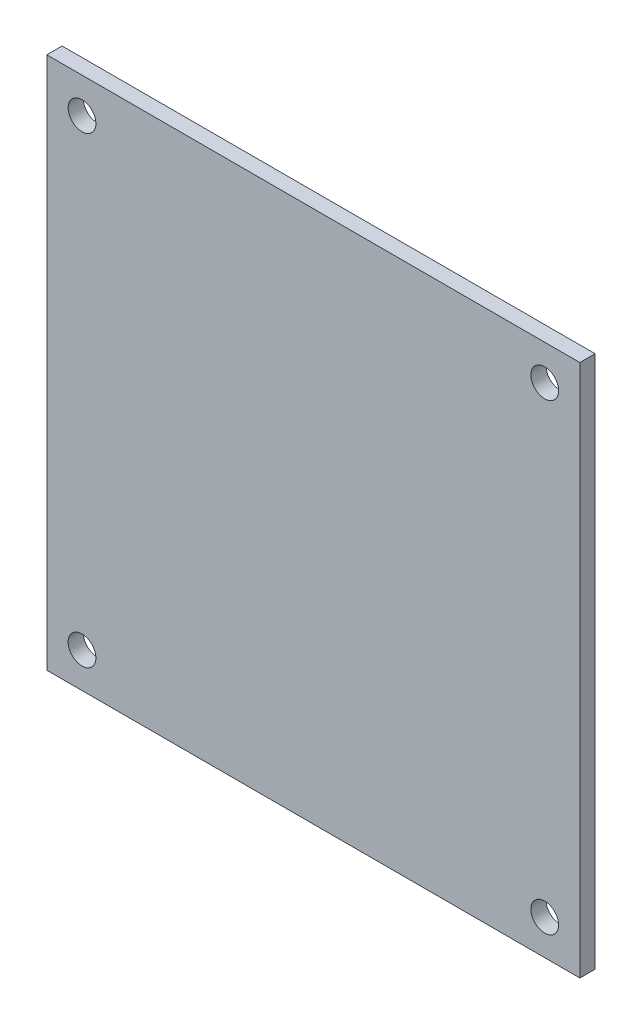
ISO-10303-21;
HEADER;
FILE_DESCRIPTION(('STEP AP214'),'2;1');
FILE_NAME('part.step','',(''),(''),'','','');
FILE_SCHEMA(('AUTOMOTIVE_DESIGN { 1 0 10303 214 1 1 1 1 }'));
ENDSEC;
DATA;
#1=APPLICATION_CONTEXT('core data for automotive mechanical design processes');
#2=APPLICATION_PROTOCOL_DEFINITION('international standard','automotive_design',2000,#1);
#3=PRODUCT_CONTEXT('',#1,'mechanical');
#4=PRODUCT('Part','Part','',(#3));
#5=PRODUCT_RELATED_PRODUCT_CATEGORY('part','',(#4));
#6=PRODUCT_DEFINITION_FORMATION('','',#4);
#7=PRODUCT_DEFINITION_CONTEXT('part definition',#1,'design');
#8=PRODUCT_DEFINITION('design','',#6,#7);
#9=PRODUCT_DEFINITION_SHAPE('','',#8);
#10=(LENGTH_UNIT() NAMED_UNIT(*) SI_UNIT(.MILLI.,.METRE.));
#11=(NAMED_UNIT(*) PLANE_ANGLE_UNIT() SI_UNIT($,.RADIAN.));
#12=(NAMED_UNIT(*) SI_UNIT($,.STERADIAN.) SOLID_ANGLE_UNIT());
#13=UNCERTAINTY_MEASURE_WITH_UNIT(LENGTH_MEASURE(1.E-05),#10,'distance_accuracy_value','');
#14=(GEOMETRIC_REPRESENTATION_CONTEXT(3) GLOBAL_UNCERTAINTY_ASSIGNED_CONTEXT((#13)) GLOBAL_UNIT_ASSIGNED_CONTEXT((#10,
#11,#12)) REPRESENTATION_CONTEXT('',''));
#15=CARTESIAN_POINT('',(0.,0.,0.));
#16=DIRECTION('',(0.,0.,1.));
#17=DIRECTION('',(1.,0.,0.));
#18=AXIS2_PLACEMENT_3D('',#15,#16,#17);
#19=CARTESIAN_POINT('',(0.,0.,1.65));
#20=DIRECTION('',(0.,0.,1.));
#21=DIRECTION('',(1.,0.,0.));
#22=AXIS2_PLACEMENT_3D('',#19,#20,#21);
#23=PLANE('',#22);
#24=CARTESIAN_POINT('',(-25.,-25.,1.65));
#25=DIRECTION('',(0.,0.,1.));
#26=DIRECTION('',(1.,0.,0.));
#27=AXIS2_PLACEMENT_3D('',#24,#25,#26);
#28=CIRCLE('',#27,1.5);
#29=CARTESIAN_POINT('',(-23.5,-25.,1.65));
#30=VERTEX_POINT('',#29);
#31=EDGE_CURVE('E124',#30,#30,#28,.T.);
#32=ORIENTED_EDGE('',*,*,#31,.F.);
#33=EDGE_LOOP('',(#32));
#34=FACE_BOUND('',#33,.T.);
#35=CARTESIAN_POINT('',(-25.,25.,1.65));
#36=DIRECTION('',(0.,0.,1.));
#37=DIRECTION('',(1.,0.,0.));
#38=AXIS2_PLACEMENT_3D('',#35,#36,#37);
#39=CIRCLE('',#38,1.5);
#40=CARTESIAN_POINT('',(-23.5,25.,1.65));
#41=VERTEX_POINT('',#40);
#42=EDGE_CURVE('E103',#41,#41,#39,.T.);
#43=ORIENTED_EDGE('',*,*,#42,.F.);
#44=EDGE_LOOP('',(#43));
#45=FACE_BOUND('',#44,.T.);
#46=DIRECTION('',(0.,1.,0.));
#47=VECTOR('',#46,1.);
#48=CARTESIAN_POINT('',(28.7977487471231,28.7977487471232,1.65));
#49=LINE('',#48,#47);
#50=CARTESIAN_POINT('',(28.7977487471232,-28.7977487471231,1.65));
#51=VERTEX_POINT('',#50);
#52=CARTESIAN_POINT('',(28.7977487471231,28.7977487471232,1.65));
#53=VERTEX_POINT('',#52);
#54=EDGE_CURVE('E88',#51,#53,#49,.T.);
#55=ORIENTED_EDGE('',*,*,#54,.T.);
#56=DIRECTION('',(-1.,0.,0.));
#57=VECTOR('',#56,1.);
#58=CARTESIAN_POINT('',(-28.7977487471232,28.7977487471232,1.65));
#59=LINE('',#58,#57);
#60=CARTESIAN_POINT('',(-28.7977487471232,28.7977487471232,1.65));
#61=VERTEX_POINT('',#60);
#62=EDGE_CURVE('E83',#53,#61,#59,.T.);
#63=ORIENTED_EDGE('',*,*,#62,.T.);
#64=DIRECTION('',(0.,-1.,0.));
#65=VECTOR('',#64,1.);
#66=CARTESIAN_POINT('',(-28.7977487471232,28.7977487471232,1.65));
#67=LINE('',#66,#65);
#68=CARTESIAN_POINT('',(-28.7977487471232,-28.7977487471231,1.65));
#69=VERTEX_POINT('',#68);
#70=EDGE_CURVE('E86',#61,#69,#67,.T.);
#71=ORIENTED_EDGE('',*,*,#70,.T.);
#72=DIRECTION('',(1.,0.,0.));
#73=VECTOR('',#72,1.);
#74=CARTESIAN_POINT('',(-28.7977487471232,-28.7977487471231,1.65));
#75=LINE('',#74,#73);
#76=EDGE_CURVE('E53',#69,#51,#75,.T.);
#77=ORIENTED_EDGE('',*,*,#76,.T.);
#78=EDGE_LOOP('',(#55,#63,#71,#77));
#79=FACE_BOUND('',#78,.T.);
#80=CARTESIAN_POINT('',(25.,25.,1.65));
#81=DIRECTION('',(0.,0.,1.));
#82=DIRECTION('',(1.,0.,0.));
#83=AXIS2_PLACEMENT_3D('',#80,#81,#82);
#84=CIRCLE('',#83,1.5);
#85=CARTESIAN_POINT('',(26.5,25.,1.65));
#86=VERTEX_POINT('',#85);
#87=EDGE_CURVE('E118',#86,#86,#84,.T.);
#88=ORIENTED_EDGE('',*,*,#87,.F.);
#89=EDGE_LOOP('',(#88));
#90=FACE_BOUND('',#89,.T.);
#91=CARTESIAN_POINT('',(25.,-25.,1.65));
#92=DIRECTION('',(0.,0.,1.));
#93=DIRECTION('',(1.,0.,0.));
#94=AXIS2_PLACEMENT_3D('',#91,#92,#93);
#95=CIRCLE('',#94,1.5);
#96=CARTESIAN_POINT('',(26.5,-25.,1.65));
#97=VERTEX_POINT('',#96);
#98=EDGE_CURVE('E130',#97,#97,#95,.T.);
#99=ORIENTED_EDGE('',*,*,#98,.F.);
#100=EDGE_LOOP('',(#99));
#101=FACE_BOUND('',#100,.T.);
#102=ADVANCED_FACE('F36',(#34,#45,#79,#90,#101),#23,.T.);
#103=CARTESIAN_POINT('',(0.,0.,0.));
#104=DIRECTION('',(0.,0.,1.));
#105=DIRECTION('',(1.,0.,0.));
#106=AXIS2_PLACEMENT_3D('',#103,#104,#105);
#107=PLANE('',#106);
#108=DIRECTION('',(0.,1.,0.));
#109=VECTOR('',#108,1.);
#110=CARTESIAN_POINT('',(28.7977487471231,28.7977487471232,0.));
#111=LINE('',#110,#109);
#112=CARTESIAN_POINT('',(28.7977487471232,-28.7977487471231,0.));
#113=VERTEX_POINT('',#112);
#114=CARTESIAN_POINT('',(28.7977487471231,28.7977487471232,0.));
#115=VERTEX_POINT('',#114);
#116=EDGE_CURVE('E100',#113,#115,#111,.T.);
#117=ORIENTED_EDGE('',*,*,#116,.F.);
#118=DIRECTION('',(1.,0.,0.));
#119=VECTOR('',#118,1.);
#120=CARTESIAN_POINT('',(-28.7977487471232,-28.7977487471231,0.));
#121=LINE('',#120,#119);
#122=CARTESIAN_POINT('',(-28.7977487471232,-28.7977487471231,0.));
#123=VERTEX_POINT('',#122);
#124=EDGE_CURVE('E76',#123,#113,#121,.T.);
#125=ORIENTED_EDGE('',*,*,#124,.F.);
#126=DIRECTION('',(0.,-1.,0.));
#127=VECTOR('',#126,1.);
#128=CARTESIAN_POINT('',(-28.7977487471232,28.7977487471232,0.));
#129=LINE('',#128,#127);
#130=CARTESIAN_POINT('',(-28.7977487471232,28.7977487471232,0.));
#131=VERTEX_POINT('',#130);
#132=EDGE_CURVE('E70',#131,#123,#129,.T.);
#133=ORIENTED_EDGE('',*,*,#132,.F.);
#134=DIRECTION('',(-1.,0.,0.));
#135=VECTOR('',#134,1.);
#136=CARTESIAN_POINT('',(-28.7977487471232,28.7977487471232,0.));
#137=LINE('',#136,#135);
#138=EDGE_CURVE('E92',#115,#131,#137,.T.);
#139=ORIENTED_EDGE('',*,*,#138,.F.);
#140=EDGE_LOOP('',(#117,#125,#133,#139));
#141=FACE_BOUND('',#140,.T.);
#142=CARTESIAN_POINT('',(-25.,25.,0.));
#143=DIRECTION('',(0.,0.,1.));
#144=DIRECTION('',(1.,0.,0.));
#145=AXIS2_PLACEMENT_3D('',#142,#143,#144);
#146=CIRCLE('',#145,1.5);
#147=CARTESIAN_POINT('',(-23.5,25.,0.));
#148=VERTEX_POINT('',#147);
#149=EDGE_CURVE('E115',#148,#148,#146,.T.);
#150=ORIENTED_EDGE('',*,*,#149,.T.);
#151=EDGE_LOOP('',(#150));
#152=FACE_BOUND('',#151,.T.);
#153=CARTESIAN_POINT('',(25.,25.,0.));
#154=DIRECTION('',(0.,0.,1.));
#155=DIRECTION('',(1.,0.,0.));
#156=AXIS2_PLACEMENT_3D('',#153,#154,#155);
#157=CIRCLE('',#156,1.5);
#158=CARTESIAN_POINT('',(26.5,25.,0.));
#159=VERTEX_POINT('',#158);
#160=EDGE_CURVE('E121',#159,#159,#157,.T.);
#161=ORIENTED_EDGE('',*,*,#160,.T.);
#162=EDGE_LOOP('',(#161));
#163=FACE_BOUND('',#162,.T.);
#164=CARTESIAN_POINT('',(-25.,-25.,0.));
#165=DIRECTION('',(0.,0.,1.));
#166=DIRECTION('',(1.,0.,0.));
#167=AXIS2_PLACEMENT_3D('',#164,#165,#166);
#168=CIRCLE('',#167,1.5);
#169=CARTESIAN_POINT('',(-23.5,-25.,0.));
#170=VERTEX_POINT('',#169);
#171=EDGE_CURVE('E127',#170,#170,#168,.T.);
#172=ORIENTED_EDGE('',*,*,#171,.T.);
#173=EDGE_LOOP('',(#172));
#174=FACE_BOUND('',#173,.T.);
#175=CARTESIAN_POINT('',(25.,-25.,0.));
#176=DIRECTION('',(0.,0.,1.));
#177=DIRECTION('',(1.,0.,0.));
#178=AXIS2_PLACEMENT_3D('',#175,#176,#177);
#179=CIRCLE('',#178,1.5);
#180=CARTESIAN_POINT('',(26.5,-25.,0.));
#181=VERTEX_POINT('',#180);
#182=EDGE_CURVE('E133',#181,#181,#179,.T.);
#183=ORIENTED_EDGE('',*,*,#182,.T.);
#184=EDGE_LOOP('',(#183));
#185=FACE_BOUND('',#184,.T.);
#186=ADVANCED_FACE('F111',(#141,#152,#163,#174,#185),#107,.F.);
#187=CARTESIAN_POINT('',(28.7977487471231,28.7977487471232,1.65));
#188=DIRECTION('',(-1.,0.,0.));
#189=DIRECTION('',(0.,-1.,0.));
#190=AXIS2_PLACEMENT_3D('',#187,#188,#189);
#191=PLANE('',#190);
#192=ORIENTED_EDGE('',*,*,#116,.T.);
#193=DIRECTION('',(0.,0.,-1.));
#194=VECTOR('',#193,1.);
#195=CARTESIAN_POINT('',(28.7977487471231,28.7977487471232,1.65));
#196=LINE('',#195,#194);
#197=EDGE_CURVE('E11',#53,#115,#196,.T.);
#198=ORIENTED_EDGE('',*,*,#197,.F.);
#199=ORIENTED_EDGE('',*,*,#54,.F.);
#200=DIRECTION('',(0.,0.,-1.));
#201=VECTOR('',#200,1.);
#202=CARTESIAN_POINT('',(28.7977487471232,-28.7977487471231,1.65));
#203=LINE('',#202,#201);
#204=EDGE_CURVE('E96',#51,#113,#203,.T.);
#205=ORIENTED_EDGE('',*,*,#204,.T.);
#206=EDGE_LOOP('',(#192,#198,#199,#205));
#207=FACE_BOUND('',#206,.T.);
#208=ADVANCED_FACE('F38',(#207),#191,.F.);
#209=CARTESIAN_POINT('',(-28.7977487471232,28.7977487471232,1.65));
#210=DIRECTION('',(0.,-1.,0.));
#211=DIRECTION('',(0.,0.,-1.));
#212=AXIS2_PLACEMENT_3D('',#209,#210,#211);
#213=PLANE('',#212);
#214=ORIENTED_EDGE('',*,*,#138,.T.);
#215=DIRECTION('',(0.,0.,-1.));
#216=VECTOR('',#215,1.);
#217=CARTESIAN_POINT('',(-28.7977487471232,28.7977487471232,1.65));
#218=LINE('',#217,#216);
#219=EDGE_CURVE('E45',#61,#131,#218,.T.);
#220=ORIENTED_EDGE('',*,*,#219,.F.);
#221=ORIENTED_EDGE('',*,*,#62,.F.);
#222=ORIENTED_EDGE('',*,*,#197,.T.);
#223=EDGE_LOOP('',(#214,#220,#221,#222));
#224=FACE_BOUND('',#223,.T.);
#225=ADVANCED_FACE('F91',(#224),#213,.F.);
#226=CARTESIAN_POINT('',(-28.7977487471232,28.7977487471232,1.65));
#227=DIRECTION('',(1.,0.,0.));
#228=DIRECTION('',(0.,1.,0.));
#229=AXIS2_PLACEMENT_3D('',#226,#227,#228);
#230=PLANE('',#229);
#231=ORIENTED_EDGE('',*,*,#132,.T.);
#232=DIRECTION('',(0.,0.,-1.));
#233=VECTOR('',#232,1.);
#234=CARTESIAN_POINT('',(-28.7977487471232,-28.7977487471231,1.65));
#235=LINE('',#234,#233);
#236=EDGE_CURVE('E93',#69,#123,#235,.T.);
#237=ORIENTED_EDGE('',*,*,#236,.F.);
#238=ORIENTED_EDGE('',*,*,#70,.F.);
#239=ORIENTED_EDGE('',*,*,#219,.T.);
#240=EDGE_LOOP('',(#231,#237,#238,#239));
#241=FACE_BOUND('',#240,.T.);
#242=ADVANCED_FACE('F94',(#241),#230,.F.);
#243=CARTESIAN_POINT('',(-28.7977487471232,-28.7977487471231,1.65));
#244=DIRECTION('',(0.,1.,0.));
#245=DIRECTION('',(0.,0.,1.));
#246=AXIS2_PLACEMENT_3D('',#243,#244,#245);
#247=PLANE('',#246);
#248=ORIENTED_EDGE('',*,*,#124,.T.);
#249=ORIENTED_EDGE('',*,*,#204,.F.);
#250=ORIENTED_EDGE('',*,*,#76,.F.);
#251=ORIENTED_EDGE('',*,*,#236,.T.);
#252=EDGE_LOOP('',(#248,#249,#250,#251));
#253=FACE_BOUND('',#252,.T.);
#254=ADVANCED_FACE('F108',(#253),#247,.F.);
#255=CARTESIAN_POINT('',(-25.,25.,1.65));
#256=DIRECTION('',(0.,0.,-1.));
#257=DIRECTION('',(-1.,0.,0.));
#258=AXIS2_PLACEMENT_3D('',#255,#256,#257);
#259=CYLINDRICAL_SURFACE('',#258,1.5);
#260=ORIENTED_EDGE('',*,*,#42,.T.);
#261=EDGE_LOOP('',(#260));
#262=FACE_BOUND('',#261,.T.);
#263=ORIENTED_EDGE('',*,*,#149,.F.);
#264=EDGE_LOOP('',(#263));
#265=FACE_BOUND('',#264,.T.);
#266=ADVANCED_FACE('F152',(#262,#265),#259,.F.);
#267=CARTESIAN_POINT('',(25.,25.,1.65));
#268=DIRECTION('',(0.,0.,-1.));
#269=DIRECTION('',(-1.,0.,0.));
#270=AXIS2_PLACEMENT_3D('',#267,#268,#269);
#271=CYLINDRICAL_SURFACE('',#270,1.5);
#272=ORIENTED_EDGE('',*,*,#87,.T.);
#273=EDGE_LOOP('',(#272));
#274=FACE_BOUND('',#273,.T.);
#275=ORIENTED_EDGE('',*,*,#160,.F.);
#276=EDGE_LOOP('',(#275));
#277=FACE_BOUND('',#276,.T.);
#278=ADVANCED_FACE('F198',(#274,#277),#271,.F.);
#279=CARTESIAN_POINT('',(-25.,-25.,1.65));
#280=DIRECTION('',(0.,0.,-1.));
#281=DIRECTION('',(-1.,0.,0.));
#282=AXIS2_PLACEMENT_3D('',#279,#280,#281);
#283=CYLINDRICAL_SURFACE('',#282,1.5);
#284=ORIENTED_EDGE('',*,*,#31,.T.);
#285=EDGE_LOOP('',(#284));
#286=FACE_BOUND('',#285,.T.);
#287=ORIENTED_EDGE('',*,*,#171,.F.);
#288=EDGE_LOOP('',(#287));
#289=FACE_BOUND('',#288,.T.);
#290=ADVANCED_FACE('F206',(#286,#289),#283,.F.);
#291=CARTESIAN_POINT('',(25.,-25.,1.65));
#292=DIRECTION('',(0.,0.,-1.));
#293=DIRECTION('',(-1.,0.,0.));
#294=AXIS2_PLACEMENT_3D('',#291,#292,#293);
#295=CYLINDRICAL_SURFACE('',#294,1.5);
#296=ORIENTED_EDGE('',*,*,#98,.T.);
#297=EDGE_LOOP('',(#296));
#298=FACE_BOUND('',#297,.T.);
#299=ORIENTED_EDGE('',*,*,#182,.F.);
#300=EDGE_LOOP('',(#299));
#301=FACE_BOUND('',#300,.T.);
#302=ADVANCED_FACE('F139',(#298,#301),#295,.F.);
#303=CLOSED_SHELL('',(#102,#186,#208,#225,#242,#254,#266,#278,#290,#302));
#304=MANIFOLD_SOLID_BREP('B2',#303);
#305=ADVANCED_BREP_SHAPE_REPRESENTATION('',(#18,#304),#14);
#306=SHAPE_DEFINITION_REPRESENTATION(#9,#305);
ENDSEC;
END-ISO-10303-21;
